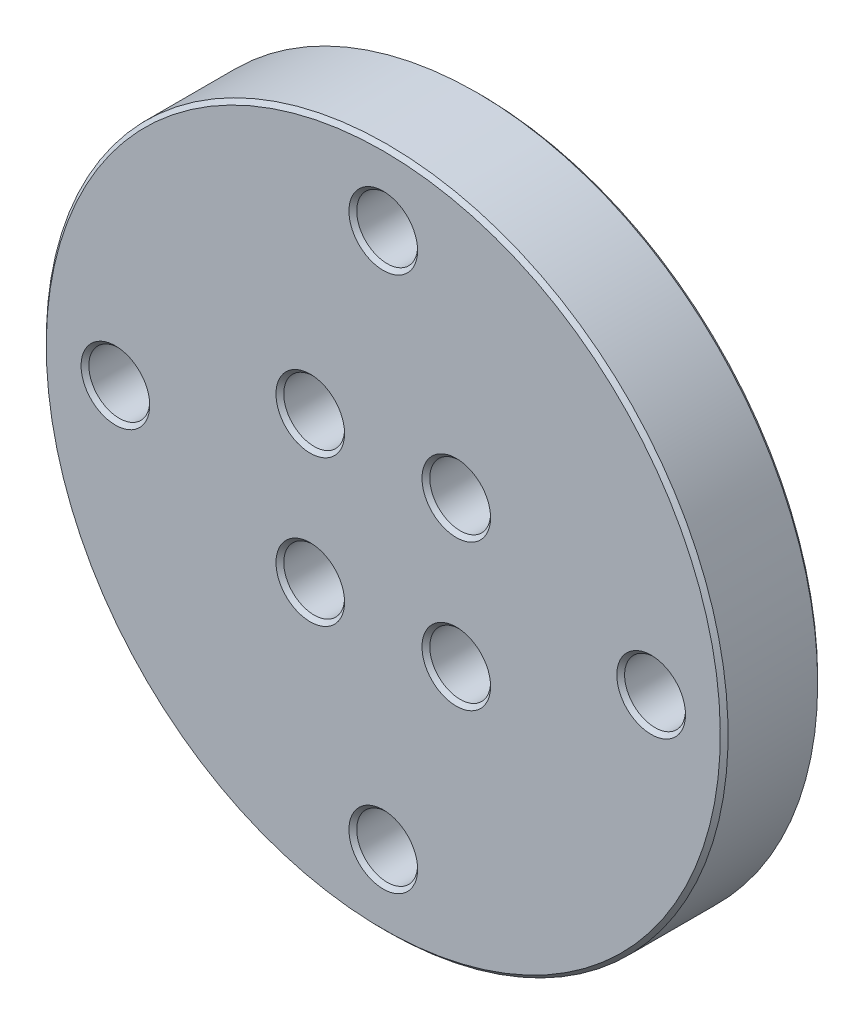
ISO-10303-21;
HEADER;
FILE_DESCRIPTION(('STEP AP214'),'2;1');
FILE_NAME('part.step','',(''),(''),'','','');
FILE_SCHEMA(('AUTOMOTIVE_DESIGN { 1 0 10303 214 1 1 1 1 }'));
ENDSEC;
DATA;
#1=APPLICATION_CONTEXT('core data for automotive mechanical design processes');
#2=APPLICATION_PROTOCOL_DEFINITION('international standard','automotive_design',2000,#1);
#3=PRODUCT_CONTEXT('',#1,'mechanical');
#4=PRODUCT('Part','Part','',(#3));
#5=PRODUCT_RELATED_PRODUCT_CATEGORY('part','',(#4));
#6=PRODUCT_DEFINITION_FORMATION('','',#4);
#7=PRODUCT_DEFINITION_CONTEXT('part definition',#1,'design');
#8=PRODUCT_DEFINITION('design','',#6,#7);
#9=PRODUCT_DEFINITION_SHAPE('','',#8);
#10=(LENGTH_UNIT() NAMED_UNIT(*) SI_UNIT(.MILLI.,.METRE.));
#11=(NAMED_UNIT(*) PLANE_ANGLE_UNIT() SI_UNIT($,.RADIAN.));
#12=(NAMED_UNIT(*) SI_UNIT($,.STERADIAN.) SOLID_ANGLE_UNIT());
#13=UNCERTAINTY_MEASURE_WITH_UNIT(LENGTH_MEASURE(1.E-05),#10,'distance_accuracy_value','');
#14=(GEOMETRIC_REPRESENTATION_CONTEXT(3) GLOBAL_UNCERTAINTY_ASSIGNED_CONTEXT((#13)) GLOBAL_UNIT_ASSIGNED_CONTEXT((#10,
#11,#12)) REPRESENTATION_CONTEXT('',''));
#15=CARTESIAN_POINT('',(0.,0.,0.));
#16=DIRECTION('',(0.,0.,1.));
#17=DIRECTION('',(1.,0.,0.));
#18=AXIS2_PLACEMENT_3D('',#15,#16,#17);
#19=CARTESIAN_POINT('',(0.,0.,12.192));
#20=DIRECTION('',(0.,0.,-1.));
#21=DIRECTION('',(0.,1.,0.));
#22=AXIS2_PLACEMENT_3D('',#19,#20,#21);
#23=CONICAL_SURFACE('',#22,44.45,0.78539816339745);
#24=CARTESIAN_POINT('',(0.,0.,12.192));
#25=DIRECTION('',(0.,0.,-1.));
#26=DIRECTION('',(0.,1.,0.));
#27=AXIS2_PLACEMENT_3D('',#24,#25,#26);
#28=CIRCLE('',#27,44.45);
#29=CARTESIAN_POINT('',(0.,44.45,12.192));
#30=VERTEX_POINT('',#29);
#31=EDGE_CURVE('E60',#30,#30,#28,.T.);
#32=ORIENTED_EDGE('',*,*,#31,.F.);
#33=EDGE_LOOP('',(#32));
#34=FACE_BOUND('',#33,.T.);
#35=CARTESIAN_POINT('',(0.,0.,12.7));
#36=DIRECTION('',(0.,0.,-1.));
#37=DIRECTION('',(0.,1.,0.));
#38=AXIS2_PLACEMENT_3D('',#35,#36,#37);
#39=CIRCLE('',#38,43.942);
#40=CARTESIAN_POINT('',(0.,43.942,12.7));
#41=VERTEX_POINT('',#40);
#42=EDGE_CURVE('E17',#41,#41,#39,.F.);
#43=ORIENTED_EDGE('',*,*,#42,.F.);
#44=EDGE_LOOP('',(#43));
#45=FACE_BOUND('',#44,.T.);
#46=ADVANCED_FACE('F13',(#34,#45),#23,.T.);
#47=CARTESIAN_POINT('',(-9.5190714876,-9.5190714876,12.7));
#48=DIRECTION('',(0.,0.,1.));
#49=DIRECTION('',(0.,-1.,0.));
#50=AXIS2_PLACEMENT_3D('',#47,#48,#49);
#51=CONICAL_SURFACE('',#50,4.4704,0.785398163397448);
#52=CARTESIAN_POINT('',(-9.5190714876,-9.5190714876,12.192));
#53=DIRECTION('',(0.,0.,-1.));
#54=DIRECTION('',(0.,1.,0.));
#55=AXIS2_PLACEMENT_3D('',#52,#53,#54);
#56=CIRCLE('',#55,3.9624);
#57=CARTESIAN_POINT('',(-9.5190714876,-5.5566714876,12.192));
#58=VERTEX_POINT('',#57);
#59=EDGE_CURVE('E57',#58,#58,#56,.T.);
#60=ORIENTED_EDGE('',*,*,#59,.T.);
#61=EDGE_LOOP('',(#60));
#62=FACE_BOUND('',#61,.T.);
#63=CARTESIAN_POINT('',(-9.5190714876,-9.5190714876,12.7));
#64=DIRECTION('',(0.,0.,1.));
#65=DIRECTION('',(1.,0.,0.));
#66=AXIS2_PLACEMENT_3D('',#63,#64,#65);
#67=CIRCLE('',#66,4.4704);
#68=CARTESIAN_POINT('',(-5.0486714876,-9.5190714876,12.7));
#69=VERTEX_POINT('',#68);
#70=EDGE_CURVE('E107',#69,#69,#67,.F.);
#71=ORIENTED_EDGE('',*,*,#70,.F.);
#72=EDGE_LOOP('',(#71));
#73=FACE_BOUND('',#72,.T.);
#74=ADVANCED_FACE('F117',(#62,#73),#51,.F.);
#75=CARTESIAN_POINT('',(9.5190714876,-9.5190714876,12.7));
#76=DIRECTION('',(0.,0.,1.));
#77=DIRECTION('',(0.,-1.,0.));
#78=AXIS2_PLACEMENT_3D('',#75,#76,#77);
#79=CONICAL_SURFACE('',#78,4.4704,0.78539816339745);
#80=CARTESIAN_POINT('',(9.5190714876,-9.5190714876,12.192));
#81=DIRECTION('',(0.,0.,-1.));
#82=DIRECTION('',(0.,1.,0.));
#83=AXIS2_PLACEMENT_3D('',#80,#81,#82);
#84=CIRCLE('',#83,3.9624);
#85=CARTESIAN_POINT('',(9.5190714876,-5.5566714876,12.192));
#86=VERTEX_POINT('',#85);
#87=EDGE_CURVE('E54',#86,#86,#84,.T.);
#88=ORIENTED_EDGE('',*,*,#87,.T.);
#89=EDGE_LOOP('',(#88));
#90=FACE_BOUND('',#89,.T.);
#91=CARTESIAN_POINT('',(9.5190714876,-9.5190714876,12.7));
#92=DIRECTION('',(0.,0.,1.));
#93=DIRECTION('',(1.,0.,0.));
#94=AXIS2_PLACEMENT_3D('',#91,#92,#93);
#95=CIRCLE('',#94,4.4704);
#96=CARTESIAN_POINT('',(13.9894714876,-9.5190714876,12.7));
#97=VERTEX_POINT('',#96);
#98=EDGE_CURVE('E105',#97,#97,#95,.F.);
#99=ORIENTED_EDGE('',*,*,#98,.F.);
#100=EDGE_LOOP('',(#99));
#101=FACE_BOUND('',#100,.T.);
#102=ADVANCED_FACE('F125',(#90,#101),#79,.F.);
#103=CARTESIAN_POINT('',(0.,-34.925,12.7));
#104=DIRECTION('',(0.,0.,1.));
#105=DIRECTION('',(0.,-1.,0.));
#106=AXIS2_PLACEMENT_3D('',#103,#104,#105);
#107=CONICAL_SURFACE('',#106,4.47675,0.785398163397448);
#108=CARTESIAN_POINT('',(0.,-34.925,12.192));
#109=DIRECTION('',(0.,0.,-1.));
#110=DIRECTION('',(0.,1.,0.));
#111=AXIS2_PLACEMENT_3D('',#108,#109,#110);
#112=CIRCLE('',#111,3.96875);
#113=CARTESIAN_POINT('',(0.,-30.95625,12.192));
#114=VERTEX_POINT('',#113);
#115=EDGE_CURVE('E51',#114,#114,#112,.T.);
#116=ORIENTED_EDGE('',*,*,#115,.T.);
#117=EDGE_LOOP('',(#116));
#118=FACE_BOUND('',#117,.T.);
#119=CARTESIAN_POINT('',(0.,-34.925,12.7));
#120=DIRECTION('',(0.,0.,1.));
#121=DIRECTION('',(1.,0.,0.));
#122=AXIS2_PLACEMENT_3D('',#119,#120,#121);
#123=CIRCLE('',#122,4.47675);
#124=CARTESIAN_POINT('',(4.47675,-34.925,12.7));
#125=VERTEX_POINT('',#124);
#126=EDGE_CURVE('E102',#125,#125,#123,.F.);
#127=ORIENTED_EDGE('',*,*,#126,.F.);
#128=EDGE_LOOP('',(#127));
#129=FACE_BOUND('',#128,.T.);
#130=ADVANCED_FACE('F262',(#118,#129),#107,.F.);
#131=CARTESIAN_POINT('',(9.5190714876,9.5190714876,12.7));
#132=DIRECTION('',(0.,0.,1.));
#133=DIRECTION('',(0.,-1.,0.));
#134=AXIS2_PLACEMENT_3D('',#131,#132,#133);
#135=CONICAL_SURFACE('',#134,4.4704,0.78539816339745);
#136=CARTESIAN_POINT('',(9.5190714876,9.5190714876,12.192));
#137=DIRECTION('',(0.,0.,-1.));
#138=DIRECTION('',(0.,1.,0.));
#139=AXIS2_PLACEMENT_3D('',#136,#137,#138);
#140=CIRCLE('',#139,3.9624);
#141=CARTESIAN_POINT('',(9.5190714876,13.4814714876,12.192));
#142=VERTEX_POINT('',#141);
#143=EDGE_CURVE('E48',#142,#142,#140,.T.);
#144=ORIENTED_EDGE('',*,*,#143,.T.);
#145=EDGE_LOOP('',(#144));
#146=FACE_BOUND('',#145,.T.);
#147=CARTESIAN_POINT('',(9.5190714876,9.5190714876,12.7));
#148=DIRECTION('',(0.,0.,1.));
#149=DIRECTION('',(1.,0.,0.));
#150=AXIS2_PLACEMENT_3D('',#147,#148,#149);
#151=CIRCLE('',#150,4.4704);
#152=CARTESIAN_POINT('',(13.9894714876,9.5190714876,12.7));
#153=VERTEX_POINT('',#152);
#154=EDGE_CURVE('E99',#153,#153,#151,.F.);
#155=ORIENTED_EDGE('',*,*,#154,.F.);
#156=EDGE_LOOP('',(#155));
#157=FACE_BOUND('',#156,.T.);
#158=ADVANCED_FACE('F271',(#146,#157),#135,.F.);
#159=CARTESIAN_POINT('',(34.925,0.,12.7));
#160=DIRECTION('',(0.,0.,1.));
#161=DIRECTION('',(0.,-1.,0.));
#162=AXIS2_PLACEMENT_3D('',#159,#160,#161);
#163=CONICAL_SURFACE('',#162,4.47675,0.78539816339745);
#164=CARTESIAN_POINT('',(34.925,0.,12.192));
#165=DIRECTION('',(0.,0.,-1.));
#166=DIRECTION('',(0.,1.,0.));
#167=AXIS2_PLACEMENT_3D('',#164,#165,#166);
#168=CIRCLE('',#167,3.96875);
#169=CARTESIAN_POINT('',(34.925,3.96875,12.192));
#170=VERTEX_POINT('',#169);
#171=EDGE_CURVE('E45',#170,#170,#168,.T.);
#172=ORIENTED_EDGE('',*,*,#171,.T.);
#173=EDGE_LOOP('',(#172));
#174=FACE_BOUND('',#173,.T.);
#175=CARTESIAN_POINT('',(34.925,0.,12.7));
#176=DIRECTION('',(0.,0.,1.));
#177=DIRECTION('',(1.,0.,0.));
#178=AXIS2_PLACEMENT_3D('',#175,#176,#177);
#179=CIRCLE('',#178,4.47675);
#180=CARTESIAN_POINT('',(39.40175,0.,12.7));
#181=VERTEX_POINT('',#180);
#182=EDGE_CURVE('E96',#181,#181,#179,.F.);
#183=ORIENTED_EDGE('',*,*,#182,.F.);
#184=EDGE_LOOP('',(#183));
#185=FACE_BOUND('',#184,.T.);
#186=ADVANCED_FACE('F277',(#174,#185),#163,.F.);
#187=CARTESIAN_POINT('',(-9.5190714876,9.5190714876,12.7));
#188=DIRECTION('',(0.,0.,1.));
#189=DIRECTION('',(0.,-1.,0.));
#190=AXIS2_PLACEMENT_3D('',#187,#188,#189);
#191=CONICAL_SURFACE('',#190,4.4704,0.785398163397448);
#192=CARTESIAN_POINT('',(-9.5190714876,9.5190714876,12.192));
#193=DIRECTION('',(0.,0.,-1.));
#194=DIRECTION('',(0.,1.,0.));
#195=AXIS2_PLACEMENT_3D('',#192,#193,#194);
#196=CIRCLE('',#195,3.9624);
#197=CARTESIAN_POINT('',(-9.5190714876,13.4814714876,12.192));
#198=VERTEX_POINT('',#197);
#199=EDGE_CURVE('E42',#198,#198,#196,.T.);
#200=ORIENTED_EDGE('',*,*,#199,.T.);
#201=EDGE_LOOP('',(#200));
#202=FACE_BOUND('',#201,.T.);
#203=CARTESIAN_POINT('',(-9.5190714876,9.5190714876,12.7));
#204=DIRECTION('',(0.,0.,1.));
#205=DIRECTION('',(1.,0.,0.));
#206=AXIS2_PLACEMENT_3D('',#203,#204,#205);
#207=CIRCLE('',#206,4.4704);
#208=CARTESIAN_POINT('',(-5.0486714876,9.5190714876,12.7));
#209=VERTEX_POINT('',#208);
#210=EDGE_CURVE('E93',#209,#209,#207,.F.);
#211=ORIENTED_EDGE('',*,*,#210,.F.);
#212=EDGE_LOOP('',(#211));
#213=FACE_BOUND('',#212,.T.);
#214=ADVANCED_FACE('F171',(#202,#213),#191,.F.);
#215=CARTESIAN_POINT('',(0.,34.925,12.7));
#216=DIRECTION('',(0.,0.,1.));
#217=DIRECTION('',(0.,-1.,0.));
#218=AXIS2_PLACEMENT_3D('',#215,#216,#217);
#219=CONICAL_SURFACE('',#218,4.47675,0.785398163397448);
#220=CARTESIAN_POINT('',(0.,34.925,12.192));
#221=DIRECTION('',(0.,0.,-1.));
#222=DIRECTION('',(0.,1.,0.));
#223=AXIS2_PLACEMENT_3D('',#220,#221,#222);
#224=CIRCLE('',#223,3.96875);
#225=CARTESIAN_POINT('',(0.,38.89375,12.192));
#226=VERTEX_POINT('',#225);
#227=EDGE_CURVE('E39',#226,#226,#224,.T.);
#228=ORIENTED_EDGE('',*,*,#227,.T.);
#229=EDGE_LOOP('',(#228));
#230=FACE_BOUND('',#229,.T.);
#231=CARTESIAN_POINT('',(0.,34.925,12.7));
#232=DIRECTION('',(0.,0.,1.));
#233=DIRECTION('',(1.,0.,0.));
#234=AXIS2_PLACEMENT_3D('',#231,#232,#233);
#235=CIRCLE('',#234,4.47675);
#236=CARTESIAN_POINT('',(4.47675,34.925,12.7));
#237=VERTEX_POINT('',#236);
#238=EDGE_CURVE('E38',#237,#237,#235,.F.);
#239=ORIENTED_EDGE('',*,*,#238,.F.);
#240=EDGE_LOOP('',(#239));
#241=FACE_BOUND('',#240,.T.);
#242=ADVANCED_FACE('F160',(#230,#241),#219,.F.);
#243=CARTESIAN_POINT('',(0.,0.,12.192));
#244=DIRECTION('',(0.,0.,-1.));
#245=DIRECTION('',(0.,1.,0.));
#246=AXIS2_PLACEMENT_3D('',#243,#244,#245);
#247=CYLINDRICAL_SURFACE('',#246,44.45);
#248=ORIENTED_EDGE('',*,*,#31,.T.);
#249=EDGE_LOOP('',(#248));
#250=FACE_BOUND('',#249,.T.);
#251=CARTESIAN_POINT('',(0.,0.,0.508));
#252=DIRECTION('',(0.,0.,-1.));
#253=DIRECTION('',(-1.,0.,0.));
#254=AXIS2_PLACEMENT_3D('',#251,#252,#253);
#255=CIRCLE('',#254,44.45);
#256=CARTESIAN_POINT('',(-44.45,0.,0.508));
#257=VERTEX_POINT('',#256);
#258=EDGE_CURVE('E35',#257,#257,#255,.T.);
#259=ORIENTED_EDGE('',*,*,#258,.F.);
#260=EDGE_LOOP('',(#259));
#261=FACE_BOUND('',#260,.T.);
#262=ADVANCED_FACE('F157',(#250,#261),#247,.T.);
#263=CARTESIAN_POINT('',(-9.5190714876,-9.5190714876,12.192));
#264=DIRECTION('',(0.,0.,-1.));
#265=DIRECTION('',(0.,1.,0.));
#266=AXIS2_PLACEMENT_3D('',#263,#264,#265);
#267=CYLINDRICAL_SURFACE('',#266,3.9624);
#268=CARTESIAN_POINT('',(-9.5190714876,-9.5190714876,0.508));
#269=DIRECTION('',(0.,0.,-1.));
#270=DIRECTION('',(-1.,0.,0.));
#271=AXIS2_PLACEMENT_3D('',#268,#269,#270);
#272=CIRCLE('',#271,3.9624);
#273=CARTESIAN_POINT('',(-13.4814714876,-9.5190714876,0.508));
#274=VERTEX_POINT('',#273);
#275=EDGE_CURVE('E32',#274,#274,#272,.T.);
#276=ORIENTED_EDGE('',*,*,#275,.T.);
#277=EDGE_LOOP('',(#276));
#278=FACE_BOUND('',#277,.T.);
#279=ORIENTED_EDGE('',*,*,#59,.F.);
#280=EDGE_LOOP('',(#279));
#281=FACE_BOUND('',#280,.T.);
#282=ADVANCED_FACE('F159',(#278,#281),#267,.F.);
#283=CARTESIAN_POINT('',(9.5190714876,-9.5190714876,12.192));
#284=DIRECTION('',(0.,0.,-1.));
#285=DIRECTION('',(0.,1.,0.));
#286=AXIS2_PLACEMENT_3D('',#283,#284,#285);
#287=CYLINDRICAL_SURFACE('',#286,3.9624);
#288=CARTESIAN_POINT('',(9.5190714876,-9.5190714876,0.508));
#289=DIRECTION('',(0.,0.,-1.));
#290=DIRECTION('',(-1.,0.,0.));
#291=AXIS2_PLACEMENT_3D('',#288,#289,#290);
#292=CIRCLE('',#291,3.9624);
#293=CARTESIAN_POINT('',(5.5566714876,-9.5190714876,0.508));
#294=VERTEX_POINT('',#293);
#295=EDGE_CURVE('E30',#294,#294,#292,.T.);
#296=ORIENTED_EDGE('',*,*,#295,.T.);
#297=EDGE_LOOP('',(#296));
#298=FACE_BOUND('',#297,.T.);
#299=ORIENTED_EDGE('',*,*,#87,.F.);
#300=EDGE_LOOP('',(#299));
#301=FACE_BOUND('',#300,.T.);
#302=ADVANCED_FACE('F167',(#298,#301),#287,.F.);
#303=CARTESIAN_POINT('',(0.,-34.925,0.508));
#304=DIRECTION('',(0.,0.,1.));
#305=DIRECTION('',(1.,0.,0.));
#306=AXIS2_PLACEMENT_3D('',#303,#304,#305);
#307=CYLINDRICAL_SURFACE('',#306,3.96875);
#308=ORIENTED_EDGE('',*,*,#115,.F.);
#309=EDGE_LOOP('',(#308));
#310=FACE_BOUND('',#309,.T.);
#311=CARTESIAN_POINT('',(0.,-34.925,0.508));
#312=DIRECTION('',(0.,0.,-1.));
#313=DIRECTION('',(-1.,0.,0.));
#314=AXIS2_PLACEMENT_3D('',#311,#312,#313);
#315=CIRCLE('',#314,3.96875);
#316=CARTESIAN_POINT('',(-3.96875,-34.925,0.508));
#317=VERTEX_POINT('',#316);
#318=EDGE_CURVE('E251',#317,#317,#315,.T.);
#319=ORIENTED_EDGE('',*,*,#318,.T.);
#320=EDGE_LOOP('',(#319));
#321=FACE_BOUND('',#320,.T.);
#322=ADVANCED_FACE('F178',(#310,#321),#307,.F.);
#323=CARTESIAN_POINT('',(9.5190714876,9.5190714876,12.192));
#324=DIRECTION('',(0.,0.,-1.));
#325=DIRECTION('',(0.,1.,0.));
#326=AXIS2_PLACEMENT_3D('',#323,#324,#325);
#327=CYLINDRICAL_SURFACE('',#326,3.9624);
#328=CARTESIAN_POINT('',(9.5190714876,9.5190714876,0.508));
#329=DIRECTION('',(0.,0.,-1.));
#330=DIRECTION('',(-1.,0.,0.));
#331=AXIS2_PLACEMENT_3D('',#328,#329,#330);
#332=CIRCLE('',#331,3.9624);
#333=CARTESIAN_POINT('',(5.5566714876,9.5190714876,0.508));
#334=VERTEX_POINT('',#333);
#335=EDGE_CURVE('E249',#334,#334,#332,.T.);
#336=ORIENTED_EDGE('',*,*,#335,.T.);
#337=EDGE_LOOP('',(#336));
#338=FACE_BOUND('',#337,.T.);
#339=ORIENTED_EDGE('',*,*,#143,.F.);
#340=EDGE_LOOP('',(#339));
#341=FACE_BOUND('',#340,.T.);
#342=ADVANCED_FACE('F182',(#338,#341),#327,.F.);
#343=CARTESIAN_POINT('',(34.925,0.,0.508));
#344=DIRECTION('',(0.,0.,1.));
#345=DIRECTION('',(1.,0.,0.));
#346=AXIS2_PLACEMENT_3D('',#343,#344,#345);
#347=CYLINDRICAL_SURFACE('',#346,3.96875);
#348=ORIENTED_EDGE('',*,*,#171,.F.);
#349=EDGE_LOOP('',(#348));
#350=FACE_BOUND('',#349,.T.);
#351=CARTESIAN_POINT('',(34.925,0.,0.508));
#352=DIRECTION('',(0.,0.,-1.));
#353=DIRECTION('',(-1.,0.,0.));
#354=AXIS2_PLACEMENT_3D('',#351,#352,#353);
#355=CIRCLE('',#354,3.96875);
#356=CARTESIAN_POINT('',(30.95625,0.,0.508));
#357=VERTEX_POINT('',#356);
#358=EDGE_CURVE('E246',#357,#357,#355,.T.);
#359=ORIENTED_EDGE('',*,*,#358,.T.);
#360=EDGE_LOOP('',(#359));
#361=FACE_BOUND('',#360,.T.);
#362=ADVANCED_FACE('F186',(#350,#361),#347,.F.);
#363=CARTESIAN_POINT('',(-9.5190714876,9.5190714876,12.192));
#364=DIRECTION('',(0.,0.,-1.));
#365=DIRECTION('',(0.,1.,0.));
#366=AXIS2_PLACEMENT_3D('',#363,#364,#365);
#367=CYLINDRICAL_SURFACE('',#366,3.9624);
#368=CARTESIAN_POINT('',(-9.5190714876,9.5190714876,0.508));
#369=DIRECTION('',(0.,0.,-1.));
#370=DIRECTION('',(-1.,0.,0.));
#371=AXIS2_PLACEMENT_3D('',#368,#369,#370);
#372=CIRCLE('',#371,3.9624);
#373=CARTESIAN_POINT('',(-13.4814714876,9.5190714876,0.508));
#374=VERTEX_POINT('',#373);
#375=EDGE_CURVE('E243',#374,#374,#372,.T.);
#376=ORIENTED_EDGE('',*,*,#375,.T.);
#377=EDGE_LOOP('',(#376));
#378=FACE_BOUND('',#377,.T.);
#379=ORIENTED_EDGE('',*,*,#199,.F.);
#380=EDGE_LOOP('',(#379));
#381=FACE_BOUND('',#380,.T.);
#382=ADVANCED_FACE('F190',(#378,#381),#367,.F.);
#383=CARTESIAN_POINT('',(0.,34.925,0.508));
#384=DIRECTION('',(0.,0.,1.));
#385=DIRECTION('',(1.,0.,0.));
#386=AXIS2_PLACEMENT_3D('',#383,#384,#385);
#387=CYLINDRICAL_SURFACE('',#386,3.96875);
#388=ORIENTED_EDGE('',*,*,#227,.F.);
#389=EDGE_LOOP('',(#388));
#390=FACE_BOUND('',#389,.T.);
#391=CARTESIAN_POINT('',(0.,34.925,0.508));
#392=DIRECTION('',(0.,0.,-1.));
#393=DIRECTION('',(-1.,0.,0.));
#394=AXIS2_PLACEMENT_3D('',#391,#392,#393);
#395=CIRCLE('',#394,3.96875);
#396=CARTESIAN_POINT('',(-3.96875,34.925,0.508));
#397=VERTEX_POINT('',#396);
#398=EDGE_CURVE('E90',#397,#397,#395,.T.);
#399=ORIENTED_EDGE('',*,*,#398,.T.);
#400=EDGE_LOOP('',(#399));
#401=FACE_BOUND('',#400,.T.);
#402=ADVANCED_FACE('F194',(#390,#401),#387,.F.);
#403=CARTESIAN_POINT('',(-44.7356965584,-44.8129605644,12.7));
#404=DIRECTION('',(0.,0.,1.));
#405=DIRECTION('',(1.,0.,0.));
#406=AXIS2_PLACEMENT_3D('',#403,#404,#405);
#407=PLANE('',#406);
#408=ORIENTED_EDGE('',*,*,#238,.T.);
#409=EDGE_LOOP('',(#408));
#410=FACE_BOUND('',#409,.T.);
#411=ORIENTED_EDGE('',*,*,#210,.T.);
#412=EDGE_LOOP('',(#411));
#413=FACE_BOUND('',#412,.T.);
#414=ORIENTED_EDGE('',*,*,#182,.T.);
#415=EDGE_LOOP('',(#414));
#416=FACE_BOUND('',#415,.T.);
#417=ORIENTED_EDGE('',*,*,#154,.T.);
#418=EDGE_LOOP('',(#417));
#419=FACE_BOUND('',#418,.T.);
#420=ORIENTED_EDGE('',*,*,#126,.T.);
#421=EDGE_LOOP('',(#420));
#422=FACE_BOUND('',#421,.T.);
#423=ORIENTED_EDGE('',*,*,#98,.T.);
#424=EDGE_LOOP('',(#423));
#425=FACE_BOUND('',#424,.T.);
#426=CARTESIAN_POINT('',(-34.925,0.,12.7));
#427=DIRECTION('',(0.,0.,1.));
#428=DIRECTION('',(0.,-1.,0.));
#429=AXIS2_PLACEMENT_3D('',#426,#427,#428);
#430=CIRCLE('',#429,4.47675);
#431=CARTESIAN_POINT('',(-34.925,-4.47675,12.7));
#432=VERTEX_POINT('',#431);
#433=EDGE_CURVE('E87',#432,#432,#430,.F.);
#434=ORIENTED_EDGE('',*,*,#433,.T.);
#435=EDGE_LOOP('',(#434));
#436=FACE_BOUND('',#435,.T.);
#437=ORIENTED_EDGE('',*,*,#70,.T.);
#438=EDGE_LOOP('',(#437));
#439=FACE_BOUND('',#438,.T.);
#440=ORIENTED_EDGE('',*,*,#42,.T.);
#441=EDGE_LOOP('',(#440));
#442=FACE_BOUND('',#441,.T.);
#443=ADVANCED_FACE('F114',(#410,#413,#416,#419,#422,#425,#436,#439,#442),#407,.T.);
#444=CARTESIAN_POINT('',(0.,0.,0.508));
#445=DIRECTION('',(0.,0.,1.));
#446=DIRECTION('',(1.,0.,0.));
#447=AXIS2_PLACEMENT_3D('',#444,#445,#446);
#448=CONICAL_SURFACE('',#447,44.45,0.78539816339745);
#449=CARTESIAN_POINT('',(0.,0.,0.));
#450=DIRECTION('',(0.,0.,1.));
#451=DIRECTION('',(1.,0.,0.));
#452=AXIS2_PLACEMENT_3D('',#449,#450,#451);
#453=CIRCLE('',#452,43.942);
#454=CARTESIAN_POINT('',(43.942,0.,0.));
#455=VERTEX_POINT('',#454);
#456=EDGE_CURVE('E84',#455,#455,#453,.T.);
#457=ORIENTED_EDGE('',*,*,#456,.T.);
#458=EDGE_LOOP('',(#457));
#459=FACE_BOUND('',#458,.T.);
#460=ORIENTED_EDGE('',*,*,#258,.T.);
#461=EDGE_LOOP('',(#460));
#462=FACE_BOUND('',#461,.T.);
#463=ADVANCED_FACE('F150',(#459,#462),#448,.T.);
#464=CARTESIAN_POINT('',(-9.5190714876,-9.5190714876,0.));
#465=DIRECTION('',(0.,0.,-1.));
#466=DIRECTION('',(-1.,0.,0.));
#467=AXIS2_PLACEMENT_3D('',#464,#465,#466);
#468=CONICAL_SURFACE('',#467,4.4704,0.785398163397448);
#469=CARTESIAN_POINT('',(-9.5190714876,-9.5190714876,0.));
#470=DIRECTION('',(0.,0.,1.));
#471=DIRECTION('',(1.,0.,0.));
#472=AXIS2_PLACEMENT_3D('',#469,#470,#471);
#473=CIRCLE('',#472,4.4704);
#474=CARTESIAN_POINT('',(-5.0486714876,-9.5190714876,0.));
#475=VERTEX_POINT('',#474);
#476=EDGE_CURVE('E81',#475,#475,#473,.F.);
#477=ORIENTED_EDGE('',*,*,#476,.T.);
#478=EDGE_LOOP('',(#477));
#479=FACE_BOUND('',#478,.T.);
#480=ORIENTED_EDGE('',*,*,#275,.F.);
#481=EDGE_LOOP('',(#480));
#482=FACE_BOUND('',#481,.T.);
#483=ADVANCED_FACE('F153',(#479,#482),#468,.F.);
#484=CARTESIAN_POINT('',(9.5190714876,-9.5190714876,0.));
#485=DIRECTION('',(0.,0.,-1.));
#486=DIRECTION('',(-1.,0.,0.));
#487=AXIS2_PLACEMENT_3D('',#484,#485,#486);
#488=CONICAL_SURFACE('',#487,4.4704,0.78539816339745);
#489=CARTESIAN_POINT('',(9.5190714876,-9.5190714876,0.));
#490=DIRECTION('',(0.,0.,1.));
#491=DIRECTION('',(1.,0.,0.));
#492=AXIS2_PLACEMENT_3D('',#489,#490,#491);
#493=CIRCLE('',#492,4.4704);
#494=CARTESIAN_POINT('',(13.9894714876,-9.5190714876,0.));
#495=VERTEX_POINT('',#494);
#496=EDGE_CURVE('E78',#495,#495,#493,.F.);
#497=ORIENTED_EDGE('',*,*,#496,.T.);
#498=EDGE_LOOP('',(#497));
#499=FACE_BOUND('',#498,.T.);
#500=ORIENTED_EDGE('',*,*,#295,.F.);
#501=EDGE_LOOP('',(#500));
#502=FACE_BOUND('',#501,.T.);
#503=ADVANCED_FACE('F204',(#499,#502),#488,.F.);
#504=CARTESIAN_POINT('',(0.,-34.925,0.));
#505=DIRECTION('',(0.,0.,-1.));
#506=DIRECTION('',(-1.,0.,0.));
#507=AXIS2_PLACEMENT_3D('',#504,#505,#506);
#508=CONICAL_SURFACE('',#507,4.47675,0.785398163397448);
#509=CARTESIAN_POINT('',(0.,-34.925,0.));
#510=DIRECTION('',(0.,0.,1.));
#511=DIRECTION('',(1.,0.,0.));
#512=AXIS2_PLACEMENT_3D('',#509,#510,#511);
#513=CIRCLE('',#512,4.47675);
#514=CARTESIAN_POINT('',(4.47675,-34.925,0.));
#515=VERTEX_POINT('',#514);
#516=EDGE_CURVE('E75',#515,#515,#513,.F.);
#517=ORIENTED_EDGE('',*,*,#516,.T.);
#518=EDGE_LOOP('',(#517));
#519=FACE_BOUND('',#518,.T.);
#520=ORIENTED_EDGE('',*,*,#318,.F.);
#521=EDGE_LOOP('',(#520));
#522=FACE_BOUND('',#521,.T.);
#523=ADVANCED_FACE('F208',(#519,#522),#508,.F.);
#524=CARTESIAN_POINT('',(9.5190714876,9.5190714876,0.));
#525=DIRECTION('',(0.,0.,-1.));
#526=DIRECTION('',(-1.,0.,0.));
#527=AXIS2_PLACEMENT_3D('',#524,#525,#526);
#528=CONICAL_SURFACE('',#527,4.4704,0.78539816339745);
#529=CARTESIAN_POINT('',(9.5190714876,9.5190714876,0.));
#530=DIRECTION('',(0.,0.,1.));
#531=DIRECTION('',(1.,0.,0.));
#532=AXIS2_PLACEMENT_3D('',#529,#530,#531);
#533=CIRCLE('',#532,4.4704);
#534=CARTESIAN_POINT('',(13.9894714876,9.5190714876,0.));
#535=VERTEX_POINT('',#534);
#536=EDGE_CURVE('E72',#535,#535,#533,.F.);
#537=ORIENTED_EDGE('',*,*,#536,.T.);
#538=EDGE_LOOP('',(#537));
#539=FACE_BOUND('',#538,.T.);
#540=ORIENTED_EDGE('',*,*,#335,.F.);
#541=EDGE_LOOP('',(#540));
#542=FACE_BOUND('',#541,.T.);
#543=ADVANCED_FACE('F212',(#539,#542),#528,.F.);
#544=CARTESIAN_POINT('',(34.925,0.,0.));
#545=DIRECTION('',(0.,0.,-1.));
#546=DIRECTION('',(-1.,0.,0.));
#547=AXIS2_PLACEMENT_3D('',#544,#545,#546);
#548=CONICAL_SURFACE('',#547,4.47675,0.78539816339745);
#549=CARTESIAN_POINT('',(34.925,0.,0.));
#550=DIRECTION('',(0.,0.,1.));
#551=DIRECTION('',(1.,0.,0.));
#552=AXIS2_PLACEMENT_3D('',#549,#550,#551);
#553=CIRCLE('',#552,4.47675);
#554=CARTESIAN_POINT('',(39.40175,0.,0.));
#555=VERTEX_POINT('',#554);
#556=EDGE_CURVE('E69',#555,#555,#553,.F.);
#557=ORIENTED_EDGE('',*,*,#556,.T.);
#558=EDGE_LOOP('',(#557));
#559=FACE_BOUND('',#558,.T.);
#560=ORIENTED_EDGE('',*,*,#358,.F.);
#561=EDGE_LOOP('',(#560));
#562=FACE_BOUND('',#561,.T.);
#563=ADVANCED_FACE('F216',(#559,#562),#548,.F.);
#564=CARTESIAN_POINT('',(-9.5190714876,9.5190714876,0.));
#565=DIRECTION('',(0.,0.,-1.));
#566=DIRECTION('',(-1.,0.,0.));
#567=AXIS2_PLACEMENT_3D('',#564,#565,#566);
#568=CONICAL_SURFACE('',#567,4.4704,0.785398163397448);
#569=CARTESIAN_POINT('',(-9.5190714876,9.5190714876,0.));
#570=DIRECTION('',(0.,0.,1.));
#571=DIRECTION('',(1.,0.,0.));
#572=AXIS2_PLACEMENT_3D('',#569,#570,#571);
#573=CIRCLE('',#572,4.4704);
#574=CARTESIAN_POINT('',(-5.0486714876,9.5190714876,0.));
#575=VERTEX_POINT('',#574);
#576=EDGE_CURVE('E66',#575,#575,#573,.F.);
#577=ORIENTED_EDGE('',*,*,#576,.T.);
#578=EDGE_LOOP('',(#577));
#579=FACE_BOUND('',#578,.T.);
#580=ORIENTED_EDGE('',*,*,#375,.F.);
#581=EDGE_LOOP('',(#580));
#582=FACE_BOUND('',#581,.T.);
#583=ADVANCED_FACE('F220',(#579,#582),#568,.F.);
#584=CARTESIAN_POINT('',(0.,34.925,0.));
#585=DIRECTION('',(0.,0.,-1.));
#586=DIRECTION('',(-1.,0.,0.));
#587=AXIS2_PLACEMENT_3D('',#584,#585,#586);
#588=CONICAL_SURFACE('',#587,4.47675,0.785398163397448);
#589=CARTESIAN_POINT('',(0.,34.925,0.));
#590=DIRECTION('',(0.,0.,1.));
#591=DIRECTION('',(1.,0.,0.));
#592=AXIS2_PLACEMENT_3D('',#589,#590,#591);
#593=CIRCLE('',#592,4.47675);
#594=CARTESIAN_POINT('',(4.47675,34.925,0.));
#595=VERTEX_POINT('',#594);
#596=EDGE_CURVE('E63',#595,#595,#593,.F.);
#597=ORIENTED_EDGE('',*,*,#596,.T.);
#598=EDGE_LOOP('',(#597));
#599=FACE_BOUND('',#598,.T.);
#600=ORIENTED_EDGE('',*,*,#398,.F.);
#601=EDGE_LOOP('',(#600));
#602=FACE_BOUND('',#601,.T.);
#603=ADVANCED_FACE('F224',(#599,#602),#588,.F.);
#604=CARTESIAN_POINT('',(-34.925,0.,12.7));
#605=DIRECTION('',(0.,0.,1.));
#606=DIRECTION('',(0.,-1.,0.));
#607=AXIS2_PLACEMENT_3D('',#604,#605,#606);
#608=CONICAL_SURFACE('',#607,4.47675,0.78539816339745);
#609=ORIENTED_EDGE('',*,*,#433,.F.);
#610=EDGE_LOOP('',(#609));
#611=FACE_BOUND('',#610,.T.);
#612=CARTESIAN_POINT('',(-34.925,0.,12.192));
#613=DIRECTION('',(0.,0.,-1.));
#614=DIRECTION('',(0.,1.,0.));
#615=AXIS2_PLACEMENT_3D('',#612,#613,#614);
#616=CIRCLE('',#615,3.96875);
#617=CARTESIAN_POINT('',(-34.925,3.96875,12.192));
#618=VERTEX_POINT('',#617);
#619=EDGE_CURVE('E26',#618,#618,#616,.T.);
#620=ORIENTED_EDGE('',*,*,#619,.T.);
#621=EDGE_LOOP('',(#620));
#622=FACE_BOUND('',#621,.T.);
#623=ADVANCED_FACE('F143',(#611,#622),#608,.F.);
#624=CARTESIAN_POINT('',(-44.7356965584,-44.6234585304,0.));
#625=DIRECTION('',(0.,0.,1.));
#626=DIRECTION('',(1.,0.,0.));
#627=AXIS2_PLACEMENT_3D('',#624,#625,#626);
#628=PLANE('',#627);
#629=ORIENTED_EDGE('',*,*,#596,.F.);
#630=EDGE_LOOP('',(#629));
#631=FACE_BOUND('',#630,.T.);
#632=ORIENTED_EDGE('',*,*,#576,.F.);
#633=EDGE_LOOP('',(#632));
#634=FACE_BOUND('',#633,.T.);
#635=ORIENTED_EDGE('',*,*,#556,.F.);
#636=EDGE_LOOP('',(#635));
#637=FACE_BOUND('',#636,.T.);
#638=ORIENTED_EDGE('',*,*,#536,.F.);
#639=EDGE_LOOP('',(#638));
#640=FACE_BOUND('',#639,.T.);
#641=ORIENTED_EDGE('',*,*,#516,.F.);
#642=EDGE_LOOP('',(#641));
#643=FACE_BOUND('',#642,.T.);
#644=ORIENTED_EDGE('',*,*,#496,.F.);
#645=EDGE_LOOP('',(#644));
#646=FACE_BOUND('',#645,.T.);
#647=CARTESIAN_POINT('',(-34.925,0.,0.));
#648=DIRECTION('',(0.,0.,-1.));
#649=DIRECTION('',(-1.,0.,0.));
#650=AXIS2_PLACEMENT_3D('',#647,#648,#649);
#651=CIRCLE('',#650,4.47675);
#652=CARTESIAN_POINT('',(-39.40175,0.,0.));
#653=VERTEX_POINT('',#652);
#654=EDGE_CURVE('E21',#653,#653,#651,.F.);
#655=ORIENTED_EDGE('',*,*,#654,.T.);
#656=EDGE_LOOP('',(#655));
#657=FACE_BOUND('',#656,.T.);
#658=ORIENTED_EDGE('',*,*,#476,.F.);
#659=EDGE_LOOP('',(#658));
#660=FACE_BOUND('',#659,.T.);
#661=ORIENTED_EDGE('',*,*,#456,.F.);
#662=EDGE_LOOP('',(#661));
#663=FACE_BOUND('',#662,.T.);
#664=ADVANCED_FACE('F136',(#631,#634,#637,#640,#643,#646,#657,#660,#663),#628,.F.);
#665=CARTESIAN_POINT('',(-34.925,0.,0.508));
#666=DIRECTION('',(0.,0.,1.));
#667=DIRECTION('',(1.,0.,0.));
#668=AXIS2_PLACEMENT_3D('',#665,#666,#667);
#669=CYLINDRICAL_SURFACE('',#668,3.96875);
#670=ORIENTED_EDGE('',*,*,#619,.F.);
#671=EDGE_LOOP('',(#670));
#672=FACE_BOUND('',#671,.T.);
#673=CARTESIAN_POINT('',(-34.925,0.,0.508));
#674=DIRECTION('',(0.,0.,-1.));
#675=DIRECTION('',(-1.,0.,0.));
#676=AXIS2_PLACEMENT_3D('',#673,#674,#675);
#677=CIRCLE('',#676,3.96875);
#678=CARTESIAN_POINT('',(-38.89375,0.,0.508));
#679=VERTEX_POINT('',#678);
#680=EDGE_CURVE('E9',#679,#679,#677,.T.);
#681=ORIENTED_EDGE('',*,*,#680,.T.);
#682=EDGE_LOOP('',(#681));
#683=FACE_BOUND('',#682,.T.);
#684=ADVANCED_FACE('F130',(#672,#683),#669,.F.);
#685=CARTESIAN_POINT('',(-34.925,0.,0.));
#686=DIRECTION('',(0.,0.,-1.));
#687=DIRECTION('',(-1.,0.,0.));
#688=AXIS2_PLACEMENT_3D('',#685,#686,#687);
#689=CONICAL_SURFACE('',#688,4.47675,0.785398163397446);
#690=ORIENTED_EDGE('',*,*,#680,.F.);
#691=EDGE_LOOP('',(#690));
#692=FACE_BOUND('',#691,.T.);
#693=ORIENTED_EDGE('',*,*,#654,.F.);
#694=EDGE_LOOP('',(#693));
#695=FACE_BOUND('',#694,.T.);
#696=ADVANCED_FACE('F15',(#692,#695),#689,.F.);
#697=CLOSED_SHELL('',(#46,#74,#102,#130,#158,#186,#214,#242,#262,#282,#302,#322,#342,#362,#382,
#402,#443,#463,#483,#503,#523,#543,#563,#583,#603,#623,#664,#684,#696));
#698=MANIFOLD_SOLID_BREP('B1',#697);
#699=ADVANCED_BREP_SHAPE_REPRESENTATION('',(#18,#698),#14);
#700=SHAPE_DEFINITION_REPRESENTATION(#9,#699);
ENDSEC;
END-ISO-10303-21;
